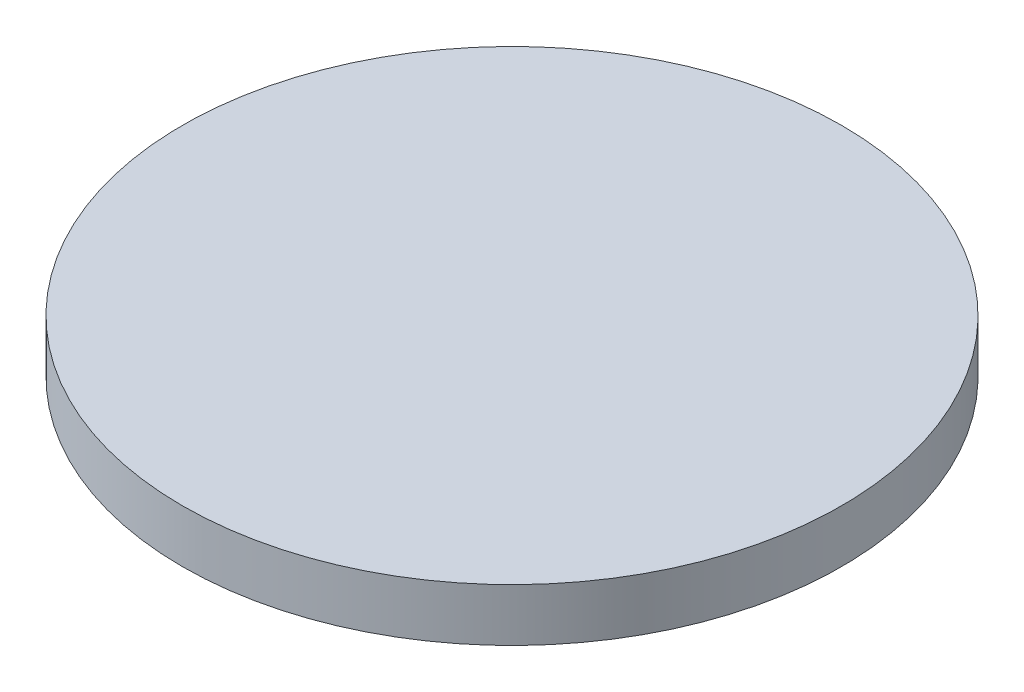
ISO-10303-21;
HEADER;
FILE_DESCRIPTION(('STEP AP214'),'2;1');
FILE_NAME('part.step','',(''),(''),'','','');
FILE_SCHEMA(('AUTOMOTIVE_DESIGN { 1 0 10303 214 1 1 1 1 }'));
ENDSEC;
DATA;
#1=APPLICATION_CONTEXT('core data for automotive mechanical design processes');
#2=APPLICATION_PROTOCOL_DEFINITION('international standard','automotive_design',2000,#1);
#3=PRODUCT_CONTEXT('',#1,'mechanical');
#4=PRODUCT('Part','Part','',(#3));
#5=PRODUCT_RELATED_PRODUCT_CATEGORY('part','',(#4));
#6=PRODUCT_DEFINITION_FORMATION('','',#4);
#7=PRODUCT_DEFINITION_CONTEXT('part definition',#1,'design');
#8=PRODUCT_DEFINITION('design','',#6,#7);
#9=PRODUCT_DEFINITION_SHAPE('','',#8);
#10=(LENGTH_UNIT() NAMED_UNIT(*) SI_UNIT(.MILLI.,.METRE.));
#11=(NAMED_UNIT(*) PLANE_ANGLE_UNIT() SI_UNIT($,.RADIAN.));
#12=(NAMED_UNIT(*) SI_UNIT($,.STERADIAN.) SOLID_ANGLE_UNIT());
#13=UNCERTAINTY_MEASURE_WITH_UNIT(LENGTH_MEASURE(1.E-05),#10,'distance_accuracy_value','');
#14=(GEOMETRIC_REPRESENTATION_CONTEXT(3) GLOBAL_UNCERTAINTY_ASSIGNED_CONTEXT((#13)) GLOBAL_UNIT_ASSIGNED_CONTEXT((#10,
#11,#12)) REPRESENTATION_CONTEXT('',''));
#15=CARTESIAN_POINT('',(0.,0.,0.));
#16=DIRECTION('',(0.,0.,1.));
#17=DIRECTION('',(1.,0.,0.));
#18=AXIS2_PLACEMENT_3D('',#15,#16,#17);
#19=CARTESIAN_POINT('',(0.,2.,0.));
#20=DIRECTION('',(0.,-1.,0.));
#21=DIRECTION('',(0.,0.,-1.));
#22=AXIS2_PLACEMENT_3D('',#19,#20,#21);
#23=CYLINDRICAL_SURFACE('',#22,12.5);
#24=CARTESIAN_POINT('',(0.,2.,0.));
#25=DIRECTION('',(0.,1.,0.));
#26=DIRECTION('',(0.,0.,1.));
#27=AXIS2_PLACEMENT_3D('',#24,#25,#26);
#28=CIRCLE('',#27,12.5);
#29=CARTESIAN_POINT('',(0.,2.,12.5));
#30=VERTEX_POINT('',#29);
#31=EDGE_CURVE('E10',#30,#30,#28,.T.);
#32=ORIENTED_EDGE('',*,*,#31,.F.);
#33=EDGE_LOOP('',(#32));
#34=FACE_BOUND('',#33,.T.);
#35=CARTESIAN_POINT('',(0.,0.,0.));
#36=DIRECTION('',(0.,1.,0.));
#37=DIRECTION('',(0.,0.,1.));
#38=AXIS2_PLACEMENT_3D('',#35,#36,#37);
#39=CIRCLE('',#38,12.5);
#40=CARTESIAN_POINT('',(0.,0.,12.5));
#41=VERTEX_POINT('',#40);
#42=EDGE_CURVE('E36',#41,#41,#39,.T.);
#43=ORIENTED_EDGE('',*,*,#42,.T.);
#44=EDGE_LOOP('',(#43));
#45=FACE_BOUND('',#44,.T.);
#46=ADVANCED_FACE('F33',(#34,#45),#23,.T.);
#47=CARTESIAN_POINT('',(0.,2.,0.));
#48=DIRECTION('',(0.,1.,0.));
#49=DIRECTION('',(0.,0.,1.));
#50=AXIS2_PLACEMENT_3D('',#47,#48,#49);
#51=PLANE('',#50);
#52=ORIENTED_EDGE('',*,*,#31,.T.);
#53=EDGE_LOOP('',(#52));
#54=FACE_BOUND('',#53,.T.);
#55=ADVANCED_FACE('F48',(#54),#51,.T.);
#56=CARTESIAN_POINT('',(0.,0.,0.));
#57=DIRECTION('',(0.,1.,0.));
#58=DIRECTION('',(0.,0.,1.));
#59=AXIS2_PLACEMENT_3D('',#56,#57,#58);
#60=PLANE('',#59);
#61=ORIENTED_EDGE('',*,*,#42,.F.);
#62=EDGE_LOOP('',(#61));
#63=FACE_BOUND('',#62,.T.);
#64=ADVANCED_FACE('F46',(#63),#60,.F.);
#65=CLOSED_SHELL('',(#46,#55,#64));
#66=MANIFOLD_SOLID_BREP('B2',#65);
#67=ADVANCED_BREP_SHAPE_REPRESENTATION('',(#18,#66),#14);
#68=SHAPE_DEFINITION_REPRESENTATION(#9,#67);
ENDSEC;
END-ISO-10303-21;
